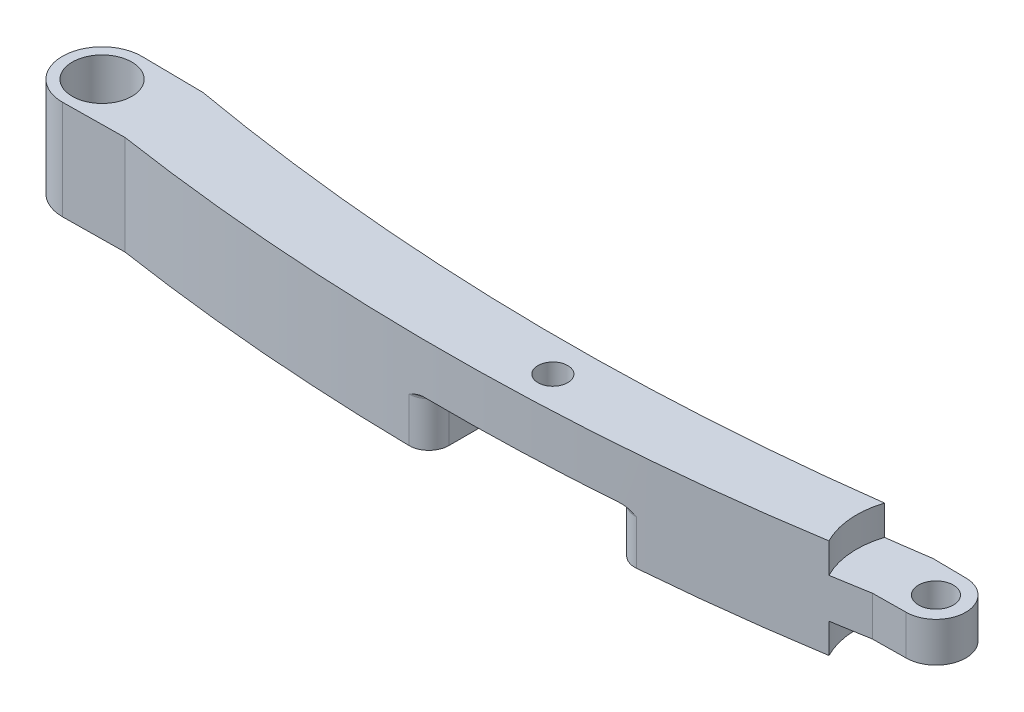
ISO-10303-21;
HEADER;
FILE_DESCRIPTION(('STEP AP214'),'2;1');
FILE_NAME('part.step','',(''),(''),'','','');
FILE_SCHEMA(('AUTOMOTIVE_DESIGN { 1 0 10303 214 1 1 1 1 }'));
ENDSEC;
DATA;
#1=APPLICATION_CONTEXT('core data for automotive mechanical design processes');
#2=APPLICATION_PROTOCOL_DEFINITION('international standard','automotive_design',2000,#1);
#3=PRODUCT_CONTEXT('',#1,'mechanical');
#4=PRODUCT('Part','Part','',(#3));
#5=PRODUCT_RELATED_PRODUCT_CATEGORY('part','',(#4));
#6=PRODUCT_DEFINITION_FORMATION('','',#4);
#7=PRODUCT_DEFINITION_CONTEXT('part definition',#1,'design');
#8=PRODUCT_DEFINITION('design','',#6,#7);
#9=PRODUCT_DEFINITION_SHAPE('','',#8);
#10=(LENGTH_UNIT() NAMED_UNIT(*) SI_UNIT(.MILLI.,.METRE.));
#11=(NAMED_UNIT(*) PLANE_ANGLE_UNIT() SI_UNIT($,.RADIAN.));
#12=(NAMED_UNIT(*) SI_UNIT($,.STERADIAN.) SOLID_ANGLE_UNIT());
#13=UNCERTAINTY_MEASURE_WITH_UNIT(LENGTH_MEASURE(1.E-05),#10,'distance_accuracy_value','');
#14=(GEOMETRIC_REPRESENTATION_CONTEXT(3) GLOBAL_UNCERTAINTY_ASSIGNED_CONTEXT((#13)) GLOBAL_UNIT_ASSIGNED_CONTEXT((#10,
#11,#12)) REPRESENTATION_CONTEXT('',''));
#15=CARTESIAN_POINT('',(0.,0.,0.));
#16=DIRECTION('',(0.,0.,1.));
#17=DIRECTION('',(1.,0.,0.));
#18=AXIS2_PLACEMENT_3D('',#15,#16,#17);
#19=CARTESIAN_POINT('',(0.,-5.,0.));
#20=DIRECTION('',(0.,1.,0.));
#21=DIRECTION('',(0.,0.,1.));
#22=AXIS2_PLACEMENT_3D('',#19,#20,#21);
#23=PLANE('',#22);
#24=CARTESIAN_POINT('',(-15.9655750112475,-5.,0.));
#25=DIRECTION('',(0.,1.,0.));
#26=DIRECTION('',(0.,0.,1.));
#27=AXIS2_PLACEMENT_3D('',#24,#25,#26);
#28=CIRCLE('',#27,3.);
#29=CARTESIAN_POINT('',(-15.9655750112475,-5.,3.));
#30=VERTEX_POINT('',#29);
#31=EDGE_CURVE('E247',#30,#30,#28,.T.);
#32=ORIENTED_EDGE('',*,*,#31,.T.);
#33=EDGE_LOOP('',(#32));
#34=FACE_BOUND('',#33,.T.);
#35=CARTESIAN_POINT('',(30.1677970186625,-5.,-230.43882689429));
#36=DIRECTION('',(0.,1.,0.));
#37=DIRECTION('',(0.,0.,1.));
#38=AXIS2_PLACEMENT_3D('',#35,#36,#37);
#39=CIRCLE('',#38,230.);
#40=CARTESIAN_POINT('',(21.5417969273626,-5.,-0.600640070548941));
#41=VERTEX_POINT('',#40);
#42=CARTESIAN_POINT('',(-9.72999293226271,-5.,-3.92576688001209));
#43=VERTEX_POINT('',#42);
#44=EDGE_CURVE('E275',#41,#43,#39,.F.);
#45=ORIENTED_EDGE('',*,*,#44,.F.);
#46=CARTESIAN_POINT('',(21.4667882309165,-5.,1.39795285835317));
#47=DIRECTION('',(0.,1.,0.));
#48=DIRECTION('',(0.,0.,1.));
#49=AXIS2_PLACEMENT_3D('',#46,#47,#48);
#50=CIRCLE('',#49,2.);
#51=CARTESIAN_POINT('',(23.4667882309166,-5.,1.39795285835317));
#52=VERTEX_POINT('',#51);
#53=EDGE_CURVE('E321',#41,#52,#50,.F.);
#54=ORIENTED_EDGE('',*,*,#53,.T.);
#55=DIRECTION('',(0.,0.,1.));
#56=VECTOR('',#55,1.);
#57=CARTESIAN_POINT('',(23.4667882309166,-5.,-4.));
#58=LINE('',#57,#56);
#59=CARTESIAN_POINT('',(23.4667882309166,-5.,4.50324565229376));
#60=VERTEX_POINT('',#59);
#61=EDGE_CURVE('E461',#52,#60,#58,.T.);
#62=ORIENTED_EDGE('',*,*,#61,.T.);
#63=CARTESIAN_POINT('',(21.4667882309165,-5.,4.50324565229376));
#64=DIRECTION('',(0.,1.,0.));
#65=DIRECTION('',(0.,0.,1.));
#66=AXIS2_PLACEMENT_3D('',#63,#64,#65);
#67=CIRCLE('',#66,2.);
#68=CARTESIAN_POINT('',(21.437864567523,-5.,6.50303649678125));
#69=VERTEX_POINT('',#68);
#70=EDGE_CURVE('E319',#60,#69,#67,.F.);
#71=ORIENTED_EDGE('',*,*,#70,.T.);
#72=CARTESIAN_POINT('',(24.7640858577867,-5.,-223.472910619277));
#73=DIRECTION('',(0.,1.,0.));
#74=DIRECTION('',(0.,0.,1.));
#75=AXIS2_PLACEMENT_3D('',#72,#73,#74);
#76=CIRCLE('',#75,230.);
#77=CARTESIAN_POINT('',(-9.72999293226271,-5.,3.92576688001209));
#78=VERTEX_POINT('',#77);
#79=EDGE_CURVE('E272',#78,#69,#76,.T.);
#80=ORIENTED_EDGE('',*,*,#79,.F.);
#81=DIRECTION('',(0.999929145853172,0.,-0.0119039184030139));
#82=VECTOR('',#81,1.);
#83=CARTESIAN_POINT('',(0.0453499256041875,-5.,3.80939375075177));
#84=LINE('',#83,#82);
#85=CARTESIAN_POINT('',(-15.9655750112475,-5.,4.));
#86=VERTEX_POINT('',#85);
#87=EDGE_CURVE('E268',#86,#78,#84,.T.);
#88=ORIENTED_EDGE('',*,*,#87,.F.);
#89=CARTESIAN_POINT('',(-15.9655750112475,-5.,0.));
#90=DIRECTION('',(0.,1.,0.));
#91=DIRECTION('',(0.,0.,1.));
#92=AXIS2_PLACEMENT_3D('',#89,#90,#91);
#93=CIRCLE('',#92,4.);
#94=CARTESIAN_POINT('',(-15.9655750112475,-5.,-4.));
#95=VERTEX_POINT('',#94);
#96=EDGE_CURVE('E252',#95,#86,#93,.T.);
#97=ORIENTED_EDGE('',*,*,#96,.F.);
#98=DIRECTION('',(0.999929145853172,0.,0.0119039184030139));
#99=VECTOR('',#98,1.);
#100=CARTESIAN_POINT('',(0.0453499256041875,-5.,-3.80939375075177));
#101=LINE('',#100,#99);
#102=EDGE_CURVE('E278',#95,#43,#101,.T.);
#103=ORIENTED_EDGE('',*,*,#102,.T.);
#104=EDGE_LOOP('',(#45,#54,#62,#71,#80,#88,#97,#103));
#105=FACE_BOUND('',#104,.T.);
#106=ADVANCED_FACE('F41',(#34,#105),#23,.F.);
#107=CARTESIAN_POINT('',(24.7640858577867,5.,-223.472910619277));
#108=DIRECTION('',(0.,-1.,0.));
#109=DIRECTION('',(0.,0.,-1.));
#110=AXIS2_PLACEMENT_3D('',#107,#108,#109);
#111=CYLINDRICAL_SURFACE('',#110,230.);
#112=DIRECTION('',(0.,-1.,0.));
#113=VECTOR('',#112,1.);
#114=CARTESIAN_POINT('',(21.437864567523,5.,6.50303649678125));
#115=LINE('',#114,#113);
#116=CARTESIAN_POINT('',(21.437864567523,-0.500000000000003,6.50303649678125));
#117=VERTEX_POINT('',#116);
#118=EDGE_CURVE('E337',#69,#117,#115,.F.);
#119=ORIENTED_EDGE('',*,*,#118,.T.);
#120=CARTESIAN_POINT('',(22.9443348755946,0.,6.51989036884661));
#121=CARTESIAN_POINT('',(22.8909089852407,-3.65314803075254E-05,6.51946780588924));
#122=CARTESIAN_POINT('',(22.8375854532841,-0.0030504474985046,6.51902713659814));
#123=CARTESIAN_POINT('',(22.7316020156731,-0.0140479396233299,6.51811483531317));
#124=CARTESIAN_POINT('',(22.678940590476,-0.0220164546860555,6.51764330101551));
#125=CARTESIAN_POINT('',(22.5750845731412,-0.0418220092257636,6.51667815301156));
#126=CARTESIAN_POINT('',(22.5238798287881,-0.0536080582595081,6.51618490058542));
#127=CARTESIAN_POINT('',(22.4222738876124,-0.0803654839305882,6.51517276330715));
#128=CARTESIAN_POINT('',(22.371873418203,-0.0953395858767263,6.51465385681788));
#129=CARTESIAN_POINT('',(22.2461769163341,-0.136207294617976,6.51331913085568));
#130=CARTESIAN_POINT('',(22.1714229675732,-0.163753634524398,6.51248799154131));
#131=CARTESIAN_POINT('',(22.0235323379046,-0.222922741607877,6.51077321209758));
#132=CARTESIAN_POINT('',(21.9503967235615,-0.254548108524291,6.50988953868131));
#133=CARTESIAN_POINT('',(21.7322471974395,-0.353512459338371,6.5071521162514));
#134=CARTESIAN_POINT('',(21.5890331263252,-0.424738635184619,6.50521778453675));
#135=CARTESIAN_POINT('',(21.4432253316456,-0.497331033007587,6.50311398390824));
#136=CARTESIAN_POINT('',(21.4405449419586,-0.49866552781418,6.50307526335833));
#137=CARTESIAN_POINT('',(21.437864567523,-0.500000000000003,6.50303649678123));
#138=B_SPLINE_CURVE_WITH_KNOTS('',3,(#120,#121,#122,#123,#124,#125,#126,#127,#128,#129,#130,
#131,#132,#133,#134,#135,#136,#137),.UNSPECIFIED.,.F.,.F.,(4,2,2,2,2,2,2,2,4),(0.,
0.160055796849207,0.319627417117926,0.477149947552301,0.634807680801527,0.873634829903894,
1.11261495301422,1.59230568562952,1.60128910114968),.UNSPECIFIED.);
#139=CARTESIAN_POINT('',(22.9443348755946,0.,6.51989036884662));
#140=VERTEX_POINT('',#139);
#141=EDGE_CURVE('E374',#117,#140,#138,.F.);
#142=ORIENTED_EDGE('',*,*,#141,.T.);
#143=CARTESIAN_POINT('',(24.7640858577867,0.,-223.472910619277));
#144=DIRECTION('',(0.,1.,0.));
#145=DIRECTION('',(-1.,0.,0.));
#146=AXIS2_PLACEMENT_3D('',#143,#144,#145);
#147=CIRCLE('',#146,230.);
#148=CARTESIAN_POINT('',(42.1289630012364,0.,5.87063309144689));
#149=VERTEX_POINT('',#148);
#150=EDGE_CURVE('E475',#140,#149,#147,.T.);
#151=ORIENTED_EDGE('',*,*,#150,.T.);
#152=CARTESIAN_POINT('',(42.1289630012364,0.,5.87063309144689));
#153=CARTESIAN_POINT('',(42.1822380835816,-3.65314802964132E-05,5.86659949247795));
#154=CARTESIAN_POINT('',(42.2354098175994,-0.00305044749846173,5.86255474882119));
#155=CARTESIAN_POINT('',(42.3410890844053,-0.0140479396231773,5.85447923591197));
#156=CARTESIAN_POINT('',(42.3935981398641,-0.0220164546858313,5.85044846139938));
#157=CARTESIAN_POINT('',(42.4971512811274,-0.0418220092254493,5.84246405272814));
#158=CARTESIAN_POINT('',(42.5482055203441,-0.053608058259216,5.83851009265485));
#159=CARTESIAN_POINT('',(42.6495105568295,-0.0803654839304287,5.83063092474933));
#160=CARTESIAN_POINT('',(42.6997606268864,-0.095339585876675,5.82670574450821));
#161=CARTESIAN_POINT('',(42.8250792949011,-0.136207294617914,5.81687601803217));
#162=CARTESIAN_POINT('',(42.8996060137187,-0.163753634524105,5.81099283605296));
#163=CARTESIAN_POINT('',(43.0470423343804,-0.222922741608122,5.79928343120091));
#164=CARTESIAN_POINT('',(43.1199508698498,-0.254548108525309,5.79345724722531));
#165=CARTESIAN_POINT('',(43.3374161946639,-0.353512459336386,5.77597749514156));
#166=CARTESIAN_POINT('',(43.4801718134044,-0.424738635173634,5.76436521183776));
#167=CARTESIAN_POINT('',(43.6255037638026,-0.497331033007014,5.75240849162221));
#168=CARTESIAN_POINT('',(43.6281754028971,-0.498665527813889,5.75218864461978));
#169=CARTESIAN_POINT('',(43.6308470236633,-0.5,5.75196875272657));
#170=B_SPLINE_CURVE_WITH_KNOTS('',3,(#152,#153,#154,#155,#156,#157,#158,#159,#160,#161,#162,
#163,#164,#165,#166,#167,#168,#169),.UNSPECIFIED.,.F.,.F.,(4,2,2,2,2,2,2,2,4),(0.,
0.160055796848258,0.319627417116233,0.47714994755149,0.634807680801499,0.873634829903871,
1.11261495301443,1.592305685629,1.60128910114972),.UNSPECIFIED.);
#171=CARTESIAN_POINT('',(43.6308470236633,-0.5,5.75196875272663));
#172=VERTEX_POINT('',#171);
#173=EDGE_CURVE('E367',#149,#172,#170,.T.);
#174=ORIENTED_EDGE('',*,*,#173,.T.);
#175=DIRECTION('',(0.,-1.,0.));
#176=VECTOR('',#175,1.);
#177=CARTESIAN_POINT('',(43.6308470236633,5.,5.75196875272663));
#178=LINE('',#177,#176);
#179=CARTESIAN_POINT('',(43.6308470236633,-5.,5.75196875272657));
#180=VERTEX_POINT('',#179);
#181=EDGE_CURVE('E340',#172,#180,#178,.T.);
#182=ORIENTED_EDGE('',*,*,#181,.T.);
#183=CARTESIAN_POINT('',(60.924244803066,-5.,3.6667884759097));
#184=VERTEX_POINT('',#183);
#185=EDGE_CURVE('E271',#180,#184,#76,.T.);
#186=ORIENTED_EDGE('',*,*,#185,.T.);
#187=DIRECTION('',(0.,1.,0.));
#188=VECTOR('',#187,1.);
#189=CARTESIAN_POINT('',(60.9242448030656,-3.5,3.66678847590988));
#190=LINE('',#189,#188);
#191=CARTESIAN_POINT('',(60.9242448030656,-2.,3.66678847590975));
#192=VERTEX_POINT('',#191);
#193=EDGE_CURVE('E217',#192,#184,#190,.F.);
#194=ORIENTED_EDGE('',*,*,#193,.F.);
#195=CARTESIAN_POINT('',(24.7640858577867,-1.99999999999997,-223.472910619277));
#196=DIRECTION('',(0.,-1.,0.));
#197=DIRECTION('',(0.,0.,-1.));
#198=AXIS2_PLACEMENT_3D('',#195,#196,#197);
#199=CIRCLE('',#198,230.);
#200=CARTESIAN_POINT('',(64.6618758087119,-2.,3.04014939500048));
#201=VERTEX_POINT('',#200);
#202=EDGE_CURVE('E224',#201,#192,#199,.T.);
#203=ORIENTED_EDGE('',*,*,#202,.F.);
#204=DIRECTION('',(0.,-1.,0.));
#205=VECTOR('',#204,1.);
#206=CARTESIAN_POINT('',(64.6618758087119,5.,3.04014939500048));
#207=LINE('',#206,#205);
#208=CARTESIAN_POINT('',(64.6618758087119,2.,3.04014939500048));
#209=VERTEX_POINT('',#208);
#210=EDGE_CURVE('E296',#209,#201,#207,.T.);
#211=ORIENTED_EDGE('',*,*,#210,.F.);
#212=CARTESIAN_POINT('',(24.7640858577867,2.00000000000003,-223.472910619277));
#213=DIRECTION('',(0.,1.,0.));
#214=DIRECTION('',(0.,0.,1.));
#215=AXIS2_PLACEMENT_3D('',#212,#213,#214);
#216=CIRCLE('',#215,230.);
#217=CARTESIAN_POINT('',(60.9242448030656,2.,3.66678847590975));
#218=VERTEX_POINT('',#217);
#219=EDGE_CURVE('E238',#218,#209,#216,.T.);
#220=ORIENTED_EDGE('',*,*,#219,.F.);
#221=DIRECTION('',(0.,1.,0.));
#222=VECTOR('',#221,1.);
#223=CARTESIAN_POINT('',(60.9242448030656,3.5,3.66678847590988));
#224=LINE('',#223,#222);
#225=CARTESIAN_POINT('',(60.924244803066,5.,3.6667884759097));
#226=VERTEX_POINT('',#225);
#227=EDGE_CURVE('E309',#226,#218,#224,.F.);
#228=ORIENTED_EDGE('',*,*,#227,.F.);
#229=CARTESIAN_POINT('',(24.7640858577867,5.,-223.472910619277));
#230=DIRECTION('',(0.,1.,0.));
#231=DIRECTION('',(0.,0.,1.));
#232=AXIS2_PLACEMENT_3D('',#229,#230,#231);
#233=CIRCLE('',#232,230.);
#234=CARTESIAN_POINT('',(-9.72999293226271,5.,3.92576688001209));
#235=VERTEX_POINT('',#234);
#236=EDGE_CURVE('E255',#235,#226,#233,.T.);
#237=ORIENTED_EDGE('',*,*,#236,.F.);
#238=DIRECTION('',(0.,-1.,0.));
#239=VECTOR('',#238,1.);
#240=CARTESIAN_POINT('',(-9.72999293226271,5.,3.92576688001209));
#241=LINE('',#240,#239);
#242=EDGE_CURVE('E299',#235,#78,#241,.T.);
#243=ORIENTED_EDGE('',*,*,#242,.T.);
#244=ORIENTED_EDGE('',*,*,#79,.T.);
#245=EDGE_LOOP('',(#119,#142,#151,#174,#182,#186,#194,#203,#211,#220,#228,#237,#243,#244));
#246=FACE_BOUND('',#245,.T.);
#247=ADVANCED_FACE('F380',(#246),#111,.T.);
#248=CARTESIAN_POINT('',(0.045349925604188,5.,3.80939375075177));
#249=DIRECTION('',(-0.011903918403014,0.,-0.999929145853172));
#250=DIRECTION('',(-0.999929145853172,0.,0.011903918403014));
#251=AXIS2_PLACEMENT_3D('',#248,#249,#250);
#252=PLANE('',#251);
#253=DIRECTION('',(-0.999929145853172,0.,0.011903918403014));
#254=VECTOR('',#253,1.);
#255=CARTESIAN_POINT('',(0.045349925604188,-2.,3.80939375075177));
#256=LINE('',#255,#254);
#257=CARTESIAN_POINT('',(68.0344249887525,-2.,3.));
#258=VERTEX_POINT('',#257);
#259=EDGE_CURVE('E244',#258,#201,#256,.T.);
#260=ORIENTED_EDGE('',*,*,#259,.F.);
#261=DIRECTION('',(0.,-1.,0.));
#262=VECTOR('',#261,1.);
#263=CARTESIAN_POINT('',(68.0344249887525,5.,3.));
#264=LINE('',#263,#262);
#265=CARTESIAN_POINT('',(68.0344249887525,2.,3.));
#266=VERTEX_POINT('',#265);
#267=EDGE_CURVE('E293',#266,#258,#264,.T.);
#268=ORIENTED_EDGE('',*,*,#267,.F.);
#269=DIRECTION('',(0.999929145853172,0.,-0.011903918403014));
#270=VECTOR('',#269,1.);
#271=CARTESIAN_POINT('',(0.045349925604188,2.,3.80939375075177));
#272=LINE('',#271,#270);
#273=EDGE_CURVE('E496',#209,#266,#272,.T.);
#274=ORIENTED_EDGE('',*,*,#273,.F.);
#275=ORIENTED_EDGE('',*,*,#210,.T.);
#276=EDGE_LOOP('',(#260,#268,#274,#275));
#277=FACE_BOUND('',#276,.T.);
#278=ADVANCED_FACE('F424',(#277),#252,.F.);
#279=CARTESIAN_POINT('',(68.0344249887525,5.,0.));
#280=DIRECTION('',(0.,-1.,0.));
#281=DIRECTION('',(0.,0.,-1.));
#282=AXIS2_PLACEMENT_3D('',#279,#280,#281);
#283=CYLINDRICAL_SURFACE('',#282,3.);
#284=CARTESIAN_POINT('',(68.0344249887525,-2.,0.));
#285=DIRECTION('',(0.,-1.,0.));
#286=DIRECTION('',(0.,0.,-1.));
#287=AXIS2_PLACEMENT_3D('',#284,#285,#286);
#288=CIRCLE('',#287,3.);
#289=CARTESIAN_POINT('',(68.0344249887525,-2.,-3.));
#290=VERTEX_POINT('',#289);
#291=EDGE_CURVE('E235',#290,#258,#288,.T.);
#292=ORIENTED_EDGE('',*,*,#291,.F.);
#293=DIRECTION('',(0.,-1.,0.));
#294=VECTOR('',#293,1.);
#295=CARTESIAN_POINT('',(68.0344249887525,5.,-3.));
#296=LINE('',#295,#294);
#297=CARTESIAN_POINT('',(68.0344249887525,2.,-3.));
#298=VERTEX_POINT('',#297);
#299=EDGE_CURVE('E290',#298,#290,#296,.T.);
#300=ORIENTED_EDGE('',*,*,#299,.F.);
#301=CARTESIAN_POINT('',(68.0344249887525,2.,0.));
#302=DIRECTION('',(0.,1.,0.));
#303=DIRECTION('',(0.,0.,1.));
#304=AXIS2_PLACEMENT_3D('',#301,#302,#303);
#305=CIRCLE('',#304,3.);
#306=EDGE_CURVE('E495',#266,#298,#305,.T.);
#307=ORIENTED_EDGE('',*,*,#306,.F.);
#308=ORIENTED_EDGE('',*,*,#267,.T.);
#309=EDGE_LOOP('',(#292,#300,#307,#308));
#310=FACE_BOUND('',#309,.T.);
#311=ADVANCED_FACE('F421',(#310),#283,.T.);
#312=CARTESIAN_POINT('',(0.0453499256041882,5.,-3.80939375075177));
#313=DIRECTION('',(0.0119039184030141,0.,-0.999929145853172));
#314=DIRECTION('',(-0.999929145853172,0.,-0.0119039184030141));
#315=AXIS2_PLACEMENT_3D('',#312,#313,#314);
#316=PLANE('',#315);
#317=ORIENTED_EDGE('',*,*,#299,.T.);
#318=DIRECTION('',(-0.999929145853172,0.,-0.0119039184030141));
#319=VECTOR('',#318,1.);
#320=CARTESIAN_POINT('',(0.0453499256041882,-2.,-3.80939375075177));
#321=LINE('',#320,#319);
#322=CARTESIAN_POINT('',(64.6618758087119,-2.,-3.0401493950005));
#323=VERTEX_POINT('',#322);
#324=EDGE_CURVE('E232',#290,#323,#321,.T.);
#325=ORIENTED_EDGE('',*,*,#324,.T.);
#326=DIRECTION('',(0.,-1.,0.));
#327=VECTOR('',#326,1.);
#328=CARTESIAN_POINT('',(64.6618758087119,5.,-3.04014939500048));
#329=LINE('',#328,#327);
#330=CARTESIAN_POINT('',(64.6618758087119,2.,-3.0401493950005));
#331=VERTEX_POINT('',#330);
#332=EDGE_CURVE('E231',#331,#323,#329,.T.);
#333=ORIENTED_EDGE('',*,*,#332,.F.);
#334=DIRECTION('',(0.999929145853172,0.,0.0119039184030141));
#335=VECTOR('',#334,1.);
#336=CARTESIAN_POINT('',(0.0453499256041882,2.,-3.80939375075177));
#337=LINE('',#336,#335);
#338=EDGE_CURVE('E492',#331,#298,#337,.T.);
#339=ORIENTED_EDGE('',*,*,#338,.T.);
#340=EDGE_LOOP('',(#317,#325,#333,#339));
#341=FACE_BOUND('',#340,.T.);
#342=ADVANCED_FACE('F415',(#341),#316,.T.);
#343=CARTESIAN_POINT('',(30.1677970186625,5.,-230.43882689429));
#344=DIRECTION('',(0.,-1.,0.));
#345=DIRECTION('',(0.,0.,-1.));
#346=AXIS2_PLACEMENT_3D('',#343,#344,#345);
#347=CYLINDRICAL_SURFACE('',#346,230.);
#348=DIRECTION('',(0.,-1.,0.));
#349=VECTOR('',#348,1.);
#350=CARTESIAN_POINT('',(43.3521417549489,5.,-0.817022498725728));
#351=LINE('',#350,#349);
#352=CARTESIAN_POINT('',(43.3521417549489,-5.,-0.817022498725756));
#353=VERTEX_POINT('',#352);
#354=CARTESIAN_POINT('',(43.3521417549489,-0.5,-0.817022498725728));
#355=VERTEX_POINT('',#354);
#356=EDGE_CURVE('E305',#353,#355,#351,.F.);
#357=ORIENTED_EDGE('',*,*,#356,.T.);
#358=CARTESIAN_POINT('',(41.8608069963465,0.,-0.736250683961438));
#359=CARTESIAN_POINT('',(41.9134203674278,-3.56024346881378E-05,-0.738928816562597));
#360=CARTESIAN_POINT('',(41.9659315841815,-0.00301796296769725,-0.741620166540574));
#361=CARTESIAN_POINT('',(42.0702938894028,-0.0139024725655392,-0.747004508732391));
#362=CARTESIAN_POINT('',(42.1221465020544,-0.0217895990163154,-0.749697470939459));
#363=CARTESIAN_POINT('',(42.2243917689125,-0.0413936747347646,-0.755041838299885));
#364=CARTESIAN_POINT('',(42.2747946381605,-0.0530595510093309,-0.757693328919903));
#365=CARTESIAN_POINT('',(42.3748007741097,-0.0795458334883899,-0.762986704892801));
#366=CARTESIAN_POINT('',(42.4244033112971,-0.0943689601448161,-0.765628579950893));
#367=CARTESIAN_POINT('',(42.5489025563035,-0.135090587195379,-0.772299248532465));
#368=CARTESIAN_POINT('',(42.6232388797979,-0.162689611445872,-0.776319299476885));
#369=CARTESIAN_POINT('',(42.7702662598534,-0.222004764894087,-0.784340365025305));
#370=CARTESIAN_POINT('',(42.8429561915289,-0.253723614871186,-0.788341365221589));
#371=CARTESIAN_POINT('',(43.0597480759411,-0.353006500108393,-0.800374757414143));
#372=CARTESIAN_POINT('',(43.2020186770184,-0.42449016441692,-0.808407826726177));
#373=CARTESIAN_POINT('',(43.3468448071096,-0.497335671265506,-0.816718406974901));
#374=CARTESIAN_POINT('',(43.3494932895905,-0.498667847237718,-0.816870430667273));
#375=CARTESIAN_POINT('',(43.3521417549489,-0.5,-0.817022498725756));
#376=B_SPLINE_CURVE_WITH_KNOTS('',3,(#358,#359,#360,#361,#362,#363,#364,#365,#366,#367,#368,
#369,#370,#371,#372,#373,#374,#375),.UNSPECIFIED.,.F.,.F.,(4,2,2,2,2,2,2,2,4),(0.,
0.157819298907594,0.315157584037585,0.470452328727351,0.625881428751009,0.863875199579752,
1.10202695102831,1.58009943635322,1.58900507191982),.UNSPECIFIED.);
#377=CARTESIAN_POINT('',(41.8608069963465,0.,-0.736250683961437));
#378=VERTEX_POINT('',#377);
#379=EDGE_CURVE('E51',#355,#378,#376,.F.);
#380=ORIENTED_EDGE('',*,*,#379,.T.);
#381=CARTESIAN_POINT('',(30.1677970186625,0.,-230.43882689429));
#382=DIRECTION('',(0.,1.,0.));
#383=DIRECTION('',(-1.,0.,0.));
#384=AXIS2_PLACEMENT_3D('',#381,#382,#383);
#385=CIRCLE('',#384,230.);
#386=CARTESIAN_POINT('',(23.0344406678973,0.,-0.549472579713245));
#387=VERTEX_POINT('',#386);
#388=EDGE_CURVE('E314',#378,#387,#385,.F.);
#389=ORIENTED_EDGE('',*,*,#388,.T.);
#390=CARTESIAN_POINT('',(23.0344406678973,0.,-0.549472579713242));
#391=CARTESIAN_POINT('',(22.9817845182925,-3.56024346867236E-05,-0.551106323760339));
#392=CARTESIAN_POINT('',(22.9292302406718,-0.00301796296774121,-0.552755309347937));
#393=CARTESIAN_POINT('',(22.8247816511968,-0.0139024725657358,-0.556068019532952));
#394=CARTESIAN_POINT('',(22.7728858160539,-0.0217895990166111,-0.557731683889343));
#395=CARTESIAN_POINT('',(22.6705546413418,-0.0413936747351605,-0.561046429640176));
#396=CARTESIAN_POINT('',(22.6201090870462,-0.0530595510096775,-0.56269739381568));
#397=CARTESIAN_POINT('',(22.5200176141812,-0.079545833488569,-0.566005583088867));
#398=CARTESIAN_POINT('',(22.4703724251864,-0.0943689601448797,-0.567662812367511));
#399=CARTESIAN_POINT('',(22.3457653386052,-0.135090587195435,-0.571862074223061));
#400=CARTESIAN_POINT('',(22.2713638884941,-0.16268961144615,-0.574406484095828));
#401=CARTESIAN_POINT('',(22.1242063090411,-0.222004764893581,-0.579508913722896));
#402=CARTESIAN_POINT('',(22.0514513046493,-0.253723614869668,-0.582066941390309));
#403=CARTESIAN_POINT('',(21.8344633475747,-0.353006500110582,-0.589796764054694));
#404=CARTESIAN_POINT('',(21.6920613726392,-0.42449016443044,-0.595005570672523));
#405=CARTESIAN_POINT('',(21.5470988658187,-0.497335671265953,-0.600441131319507));
#406=CARTESIAN_POINT('',(21.5444478884712,-0.498667847237947,-0.600540578585671));
#407=CARTESIAN_POINT('',(21.5417969273626,-0.500000000000003,-0.600640070548929));
#408=B_SPLINE_CURVE_WITH_KNOTS('',3,(#390,#391,#392,#393,#394,#395,#396,#397,#398,#399,#400,
#401,#402,#403,#404,#405,#406,#407),.UNSPECIFIED.,.F.,.F.,(4,2,2,2,2,2,2,2,4),(0.,
0.157819298908778,0.315157584039693,0.470452328728353,0.62588142875104,0.863875199579542,
1.10202695102758,1.58009943635297,1.58900507191978),.UNSPECIFIED.);
#409=CARTESIAN_POINT('',(21.5417969273626,-0.500000000000003,-0.600640070548886));
#410=VERTEX_POINT('',#409);
#411=EDGE_CURVE('E11',#387,#410,#408,.T.);
#412=ORIENTED_EDGE('',*,*,#411,.T.);
#413=DIRECTION('',(0.,-1.,0.));
#414=VECTOR('',#413,1.);
#415=CARTESIAN_POINT('',(21.5417969273626,5.,-0.600640070548886));
#416=LINE('',#415,#414);
#417=EDGE_CURVE('E317',#410,#41,#416,.T.);
#418=ORIENTED_EDGE('',*,*,#417,.T.);
#419=ORIENTED_EDGE('',*,*,#44,.T.);
#420=DIRECTION('',(0.,-1.,0.));
#421=VECTOR('',#420,1.);
#422=CARTESIAN_POINT('',(-9.72999293226271,5.,-3.92576688001209));
#423=LINE('',#422,#421);
#424=CARTESIAN_POINT('',(-9.72999293226271,5.,-3.92576688001209));
#425=VERTEX_POINT('',#424);
#426=EDGE_CURVE('E286',#425,#43,#423,.T.);
#427=ORIENTED_EDGE('',*,*,#426,.F.);
#428=CARTESIAN_POINT('',(30.1677970186625,5.,-230.43882689429));
#429=DIRECTION('',(0.,1.,0.));
#430=DIRECTION('',(0.,0.,1.));
#431=AXIS2_PLACEMENT_3D('',#428,#429,#430);
#432=CIRCLE('',#431,230.);
#433=CARTESIAN_POINT('',(60.4144299780924,5.,-2.43632428824944));
#434=VERTEX_POINT('',#433);
#435=EDGE_CURVE('E258',#434,#425,#432,.F.);
#436=ORIENTED_EDGE('',*,*,#435,.F.);
#437=DIRECTION('',(0.,1.,0.));
#438=VECTOR('',#437,1.);
#439=CARTESIAN_POINT('',(60.4144299780924,3.5,-2.43632428824944));
#440=LINE('',#439,#438);
#441=CARTESIAN_POINT('',(60.4144299780923,2.,-2.43632428824941));
#442=VERTEX_POINT('',#441);
#443=EDGE_CURVE('E488',#442,#434,#440,.T.);
#444=ORIENTED_EDGE('',*,*,#443,.F.);
#445=CARTESIAN_POINT('',(30.1677970186625,2.00000000000003,-230.43882689429));
#446=DIRECTION('',(0.,1.,0.));
#447=DIRECTION('',(0.,0.,1.));
#448=AXIS2_PLACEMENT_3D('',#445,#446,#447);
#449=CIRCLE('',#448,230.);
#450=EDGE_CURVE('E308',#331,#442,#449,.F.);
#451=ORIENTED_EDGE('',*,*,#450,.F.);
#452=ORIENTED_EDGE('',*,*,#332,.T.);
#453=CARTESIAN_POINT('',(30.1677970186625,-1.99999999999997,-230.43882689429));
#454=DIRECTION('',(0.,-1.,0.));
#455=DIRECTION('',(0.,0.,-1.));
#456=AXIS2_PLACEMENT_3D('',#453,#454,#455);
#457=CIRCLE('',#456,230.);
#458=CARTESIAN_POINT('',(60.4144299780923,-2.,-2.43632428824941));
#459=VERTEX_POINT('',#458);
#460=EDGE_CURVE('E221',#459,#323,#457,.F.);
#461=ORIENTED_EDGE('',*,*,#460,.F.);
#462=DIRECTION('',(0.,1.,0.));
#463=VECTOR('',#462,1.);
#464=CARTESIAN_POINT('',(60.4144299780924,-3.5,-2.43632428824944));
#465=LINE('',#464,#463);
#466=CARTESIAN_POINT('',(60.4144299780924,-5.,-2.43632428824944));
#467=VERTEX_POINT('',#466);
#468=EDGE_CURVE('E206',#467,#459,#465,.T.);
#469=ORIENTED_EDGE('',*,*,#468,.F.);
#470=EDGE_CURVE('E276',#467,#353,#39,.F.);
#471=ORIENTED_EDGE('',*,*,#470,.T.);
#472=EDGE_LOOP('',(#357,#380,#389,#412,#418,#419,#427,#436,#444,#451,#452,#461,#469,#471));
#473=FACE_BOUND('',#472,.T.);
#474=ADVANCED_FACE('F228',(#473),#347,.F.);
#475=CARTESIAN_POINT('',(0.0453499256041875,5.,3.80939375075177));
#476=DIRECTION('',(-0.0119039184030139,0.,-0.999929145853172));
#477=DIRECTION('',(-0.999929145853172,0.,0.0119039184030139));
#478=AXIS2_PLACEMENT_3D('',#475,#476,#477);
#479=PLANE('',#478);
#480=ORIENTED_EDGE('',*,*,#87,.T.);
#481=ORIENTED_EDGE('',*,*,#242,.F.);
#482=DIRECTION('',(0.999929145853172,0.,-0.0119039184030139));
#483=VECTOR('',#482,1.);
#484=CARTESIAN_POINT('',(0.0453499256041875,5.,3.80939375075177));
#485=LINE('',#484,#483);
#486=CARTESIAN_POINT('',(-15.9655750112475,5.,4.));
#487=VERTEX_POINT('',#486);
#488=EDGE_CURVE('E251',#487,#235,#485,.T.);
#489=ORIENTED_EDGE('',*,*,#488,.F.);
#490=DIRECTION('',(0.,-1.,0.));
#491=VECTOR('',#490,1.);
#492=CARTESIAN_POINT('',(-15.9655750112475,5.,4.));
#493=LINE('',#492,#491);
#494=EDGE_CURVE('E265',#487,#86,#493,.T.);
#495=ORIENTED_EDGE('',*,*,#494,.T.);
#496=EDGE_LOOP('',(#480,#481,#489,#495));
#497=FACE_BOUND('',#496,.T.);
#498=ADVANCED_FACE('F414',(#497),#479,.F.);
#499=CARTESIAN_POINT('',(0.0453499256041875,5.,-3.80939375075177));
#500=DIRECTION('',(0.0119039184030139,0.,-0.999929145853172));
#501=DIRECTION('',(-0.999929145853172,0.,-0.0119039184030139));
#502=AXIS2_PLACEMENT_3D('',#499,#500,#501);
#503=PLANE('',#502);
#504=ORIENTED_EDGE('',*,*,#102,.F.);
#505=DIRECTION('',(0.,-1.,0.));
#506=VECTOR('',#505,1.);
#507=CARTESIAN_POINT('',(-15.9655750112475,5.,-4.));
#508=LINE('',#507,#506);
#509=CARTESIAN_POINT('',(-15.9655750112475,5.,-4.));
#510=VERTEX_POINT('',#509);
#511=EDGE_CURVE('E284',#510,#95,#508,.T.);
#512=ORIENTED_EDGE('',*,*,#511,.F.);
#513=DIRECTION('',(0.999929145853172,0.,0.0119039184030139));
#514=VECTOR('',#513,1.);
#515=CARTESIAN_POINT('',(0.0453499256041875,5.,-3.80939375075177));
#516=LINE('',#515,#514);
#517=EDGE_CURVE('E260',#510,#425,#516,.T.);
#518=ORIENTED_EDGE('',*,*,#517,.T.);
#519=ORIENTED_EDGE('',*,*,#426,.T.);
#520=EDGE_LOOP('',(#504,#512,#518,#519));
#521=FACE_BOUND('',#520,.T.);
#522=ADVANCED_FACE('F416',(#521),#503,.T.);
#523=CARTESIAN_POINT('',(-15.9655750112475,5.,0.));
#524=DIRECTION('',(0.,-1.,0.));
#525=DIRECTION('',(0.,0.,-1.));
#526=AXIS2_PLACEMENT_3D('',#523,#524,#525);
#527=CYLINDRICAL_SURFACE('',#526,3.);
#528=CARTESIAN_POINT('',(-15.9655750112475,5.,0.));
#529=DIRECTION('',(0.,1.,0.));
#530=DIRECTION('',(0.,0.,1.));
#531=AXIS2_PLACEMENT_3D('',#528,#529,#530);
#532=CIRCLE('',#531,3.);
#533=CARTESIAN_POINT('',(-15.9655750112475,5.,3.));
#534=VERTEX_POINT('',#533);
#535=EDGE_CURVE('E248',#534,#534,#532,.T.);
#536=ORIENTED_EDGE('',*,*,#535,.T.);
#537=EDGE_LOOP('',(#536));
#538=FACE_BOUND('',#537,.T.);
#539=ORIENTED_EDGE('',*,*,#31,.F.);
#540=EDGE_LOOP('',(#539));
#541=FACE_BOUND('',#540,.T.);
#542=ADVANCED_FACE('F714',(#538,#541),#527,.F.);
#543=CARTESIAN_POINT('',(-15.9655750112475,5.,0.));
#544=DIRECTION('',(0.,-1.,0.));
#545=DIRECTION('',(0.,0.,-1.));
#546=AXIS2_PLACEMENT_3D('',#543,#544,#545);
#547=CYLINDRICAL_SURFACE('',#546,4.);
#548=ORIENTED_EDGE('',*,*,#96,.T.);
#549=ORIENTED_EDGE('',*,*,#494,.F.);
#550=CARTESIAN_POINT('',(-15.9655750112475,5.,0.));
#551=DIRECTION('',(0.,1.,0.));
#552=DIRECTION('',(0.,0.,1.));
#553=AXIS2_PLACEMENT_3D('',#550,#551,#552);
#554=CIRCLE('',#553,4.);
#555=EDGE_CURVE('E263',#510,#487,#554,.T.);
#556=ORIENTED_EDGE('',*,*,#555,.F.);
#557=ORIENTED_EDGE('',*,*,#511,.T.);
#558=EDGE_LOOP('',(#548,#549,#556,#557));
#559=FACE_BOUND('',#558,.T.);
#560=ADVANCED_FACE('F452',(#559),#547,.T.);
#561=CARTESIAN_POINT('',(0.,5.,0.));
#562=DIRECTION('',(0.,1.,0.));
#563=DIRECTION('',(0.,0.,1.));
#564=AXIS2_PLACEMENT_3D('',#561,#562,#563);
#565=PLANE('',#564);
#566=CARTESIAN_POINT('',(32.4667882309166,5.,3.02280968401822));
#567=DIRECTION('',(0.,1.,0.));
#568=DIRECTION('',(0.,0.,1.));
#569=AXIS2_PLACEMENT_3D('',#566,#567,#568);
#570=CIRCLE('',#569,1.5);
#571=CARTESIAN_POINT('',(32.4667882309166,5.,4.52280968401822));
#572=VERTEX_POINT('',#571);
#573=EDGE_CURVE('E478',#572,#572,#570,.T.);
#574=ORIENTED_EDGE('',*,*,#573,.F.);
#575=EDGE_LOOP('',(#574));
#576=FACE_BOUND('',#575,.T.);
#577=ORIENTED_EDGE('',*,*,#535,.F.);
#578=EDGE_LOOP('',(#577));
#579=FACE_BOUND('',#578,.T.);
#580=ORIENTED_EDGE('',*,*,#236,.T.);
#581=CARTESIAN_POINT('',(68.0344249887525,5.,0.));
#582=DIRECTION('',(0.,1.,0.));
#583=DIRECTION('',(0.,0.,1.));
#584=AXIS2_PLACEMENT_3D('',#581,#582,#583);
#585=CIRCLE('',#584,8.);
#586=EDGE_CURVE('E302',#226,#434,#585,.F.);
#587=ORIENTED_EDGE('',*,*,#586,.T.);
#588=ORIENTED_EDGE('',*,*,#435,.T.);
#589=ORIENTED_EDGE('',*,*,#517,.F.);
#590=ORIENTED_EDGE('',*,*,#555,.T.);
#591=ORIENTED_EDGE('',*,*,#488,.T.);
#592=EDGE_LOOP('',(#580,#587,#588,#589,#590,#591));
#593=FACE_BOUND('',#592,.T.);
#594=ADVANCED_FACE('F444',(#576,#579,#593),#565,.T.);
#595=DIRECTION('',(0.,0.,1.));
#596=VECTOR('',#595,1.);
#597=CARTESIAN_POINT('',(41.4667882309166,-5.,-4.));
#598=LINE('',#597,#596);
#599=CARTESIAN_POINT('',(41.4667882309166,-5.,1.17968884384437));
#600=VERTEX_POINT('',#599);
#601=CARTESIAN_POINT('',(41.4667882309166,-5.,3.75870893210045));
#602=VERTEX_POINT('',#601);
#603=EDGE_CURVE('E315',#600,#602,#598,.T.);
#604=ORIENTED_EDGE('',*,*,#603,.F.);
#605=CARTESIAN_POINT('',(43.4667882309166,-5.,1.17968884384437));
#606=DIRECTION('',(0.,1.,0.));
#607=DIRECTION('',(0.,0.,1.));
#608=AXIS2_PLACEMENT_3D('',#605,#606,#607);
#609=CIRCLE('',#608,2.);
#610=EDGE_CURVE('E335',#600,#353,#609,.F.);
#611=ORIENTED_EDGE('',*,*,#610,.T.);
#612=ORIENTED_EDGE('',*,*,#470,.F.);
#613=CARTESIAN_POINT('',(68.0344249887525,-5.,0.));
#614=DIRECTION('',(0.,1.,0.));
#615=DIRECTION('',(0.,0.,1.));
#616=AXIS2_PLACEMENT_3D('',#613,#614,#615);
#617=CIRCLE('',#616,8.);
#618=EDGE_CURVE('E213',#467,#184,#617,.T.);
#619=ORIENTED_EDGE('',*,*,#618,.T.);
#620=ORIENTED_EDGE('',*,*,#185,.F.);
#621=CARTESIAN_POINT('',(43.4667882309166,-5.,3.75870893210045));
#622=DIRECTION('',(0.,1.,0.));
#623=DIRECTION('',(0.,0.,1.));
#624=AXIS2_PLACEMENT_3D('',#621,#622,#623);
#625=CIRCLE('',#624,2.);
#626=EDGE_CURVE('E333',#180,#602,#625,.F.);
#627=ORIENTED_EDGE('',*,*,#626,.T.);
#628=EDGE_LOOP('',(#604,#611,#612,#619,#620,#627));
#629=FACE_BOUND('',#628,.T.);
#630=ADVANCED_FACE('F437',(#629),#23,.F.);
#631=CARTESIAN_POINT('',(68.0344249887525,-2.,-8.));
#632=DIRECTION('',(0.,-1.,0.));
#633=DIRECTION('',(0.,0.,-1.));
#634=AXIS2_PLACEMENT_3D('',#631,#632,#633);
#635=PLANE('',#634);
#636=CARTESIAN_POINT('',(68.0344249887525,-2.,0.));
#637=DIRECTION('',(0.,-1.,0.));
#638=DIRECTION('',(0.,0.,-1.));
#639=AXIS2_PLACEMENT_3D('',#636,#637,#638);
#640=CIRCLE('',#639,1.75);
#641=CARTESIAN_POINT('',(68.0344249887525,-2.,-1.75));
#642=VERTEX_POINT('',#641);
#643=EDGE_CURVE('E233',#642,#642,#640,.T.);
#644=ORIENTED_EDGE('',*,*,#643,.F.);
#645=EDGE_LOOP('',(#644));
#646=FACE_BOUND('',#645,.T.);
#647=ORIENTED_EDGE('',*,*,#202,.T.);
#648=CARTESIAN_POINT('',(68.0344249887525,-2.,0.));
#649=DIRECTION('',(0.,1.,0.));
#650=DIRECTION('',(0.,0.,1.));
#651=AXIS2_PLACEMENT_3D('',#648,#649,#650);
#652=CIRCLE('',#651,8.);
#653=EDGE_CURVE('E210',#459,#192,#652,.T.);
#654=ORIENTED_EDGE('',*,*,#653,.F.);
#655=ORIENTED_EDGE('',*,*,#460,.T.);
#656=ORIENTED_EDGE('',*,*,#324,.F.);
#657=ORIENTED_EDGE('',*,*,#291,.T.);
#658=ORIENTED_EDGE('',*,*,#259,.T.);
#659=EDGE_LOOP('',(#647,#654,#655,#656,#657,#658));
#660=FACE_BOUND('',#659,.T.);
#661=ADVANCED_FACE('F220',(#646,#660),#635,.T.);
#662=CARTESIAN_POINT('',(68.0344249887525,6.01049549134913,0.));
#663=DIRECTION('',(0.,1.,0.));
#664=DIRECTION('',(0.,0.,1.));
#665=AXIS2_PLACEMENT_3D('',#662,#663,#664);
#666=CYLINDRICAL_SURFACE('',#665,8.);
#667=ORIENTED_EDGE('',*,*,#193,.T.);
#668=ORIENTED_EDGE('',*,*,#618,.F.);
#669=ORIENTED_EDGE('',*,*,#468,.T.);
#670=ORIENTED_EDGE('',*,*,#653,.T.);
#671=EDGE_LOOP('',(#667,#668,#669,#670));
#672=FACE_BOUND('',#671,.T.);
#673=ADVANCED_FACE('F209',(#672),#666,.F.);
#674=CARTESIAN_POINT('',(68.0344249887525,2.,0.));
#675=DIRECTION('',(0.,1.,0.));
#676=DIRECTION('',(0.,0.,1.));
#677=AXIS2_PLACEMENT_3D('',#674,#675,#676);
#678=PLANE('',#677);
#679=CARTESIAN_POINT('',(68.0344249887525,2.,0.));
#680=DIRECTION('',(0.,1.,0.));
#681=DIRECTION('',(0.,0.,1.));
#682=AXIS2_PLACEMENT_3D('',#679,#680,#681);
#683=CIRCLE('',#682,1.75);
#684=CARTESIAN_POINT('',(68.0344249887525,2.,1.75));
#685=VERTEX_POINT('',#684);
#686=EDGE_CURVE('E306',#685,#685,#683,.T.);
#687=ORIENTED_EDGE('',*,*,#686,.F.);
#688=EDGE_LOOP('',(#687));
#689=FACE_BOUND('',#688,.T.);
#690=ORIENTED_EDGE('',*,*,#219,.T.);
#691=ORIENTED_EDGE('',*,*,#273,.T.);
#692=ORIENTED_EDGE('',*,*,#306,.T.);
#693=ORIENTED_EDGE('',*,*,#338,.F.);
#694=ORIENTED_EDGE('',*,*,#450,.T.);
#695=CARTESIAN_POINT('',(68.0344249887525,2.,0.));
#696=DIRECTION('',(0.,1.,0.));
#697=DIRECTION('',(0.,0.,1.));
#698=AXIS2_PLACEMENT_3D('',#695,#696,#697);
#699=CIRCLE('',#698,8.);
#700=EDGE_CURVE('E225',#442,#218,#699,.T.);
#701=ORIENTED_EDGE('',*,*,#700,.T.);
#702=EDGE_LOOP('',(#690,#691,#692,#693,#694,#701));
#703=FACE_BOUND('',#702,.T.);
#704=ADVANCED_FACE('F501',(#689,#703),#678,.T.);
#705=CARTESIAN_POINT('',(68.0344249887525,6.01049549134913,0.));
#706=DIRECTION('',(0.,1.,0.));
#707=DIRECTION('',(0.,0.,1.));
#708=AXIS2_PLACEMENT_3D('',#705,#706,#707);
#709=CYLINDRICAL_SURFACE('',#708,8.);
#710=ORIENTED_EDGE('',*,*,#227,.T.);
#711=ORIENTED_EDGE('',*,*,#700,.F.);
#712=ORIENTED_EDGE('',*,*,#443,.T.);
#713=ORIENTED_EDGE('',*,*,#586,.F.);
#714=EDGE_LOOP('',(#710,#711,#712,#713));
#715=FACE_BOUND('',#714,.T.);
#716=ADVANCED_FACE('F665',(#715),#709,.F.);
#717=CARTESIAN_POINT('',(68.0344249887525,5.,0.));
#718=DIRECTION('',(0.,-1.,0.));
#719=DIRECTION('',(0.,0.,-1.));
#720=AXIS2_PLACEMENT_3D('',#717,#718,#719);
#721=CYLINDRICAL_SURFACE('',#720,1.75);
#722=ORIENTED_EDGE('',*,*,#686,.T.);
#723=EDGE_LOOP('',(#722));
#724=FACE_BOUND('',#723,.T.);
#725=ORIENTED_EDGE('',*,*,#643,.T.);
#726=EDGE_LOOP('',(#725));
#727=FACE_BOUND('',#726,.T.);
#728=ADVANCED_FACE('F660',(#724,#727),#721,.F.);
#729=CARTESIAN_POINT('',(32.4667882309166,-5.,3.02280968401822));
#730=DIRECTION('',(0.,1.,0.));
#731=DIRECTION('',(0.,0.,1.));
#732=AXIS2_PLACEMENT_3D('',#729,#730,#731);
#733=CYLINDRICAL_SURFACE('',#732,1.5);
#734=CARTESIAN_POINT('',(32.4667882309166,0.,3.02280968401822));
#735=DIRECTION('',(0.,1.,0.));
#736=DIRECTION('',(-1.,0.,0.));
#737=AXIS2_PLACEMENT_3D('',#734,#735,#736);
#738=CIRCLE('',#737,1.5);
#739=CARTESIAN_POINT('',(30.9667882309166,0.,3.02280968401822));
#740=VERTEX_POINT('',#739);
#741=EDGE_CURVE('E311',#740,#740,#738,.F.);
#742=ORIENTED_EDGE('',*,*,#741,.T.);
#743=EDGE_LOOP('',(#742));
#744=FACE_BOUND('',#743,.T.);
#745=ORIENTED_EDGE('',*,*,#573,.T.);
#746=EDGE_LOOP('',(#745));
#747=FACE_BOUND('',#746,.T.);
#748=ADVANCED_FACE('F621',(#744,#747),#733,.F.);
#749=CARTESIAN_POINT('',(23.4667882309166,0.,-4.));
#750=DIRECTION('',(-1.,0.,0.));
#751=DIRECTION('',(0.,-1.,0.));
#752=AXIS2_PLACEMENT_3D('',#749,#750,#751);
#753=PLANE('',#752);
#754=DIRECTION('',(0.,-1.,0.));
#755=VECTOR('',#754,1.);
#756=CARTESIAN_POINT('',(23.4667882309166,0.,1.39795285835317));
#757=LINE('',#756,#755);
#758=CARTESIAN_POINT('',(23.4667882309166,-0.500000000000003,1.39795285835317));
#759=VERTEX_POINT('',#758);
#760=EDGE_CURVE('E325',#52,#759,#757,.F.);
#761=ORIENTED_EDGE('',*,*,#760,.T.);
#762=DIRECTION('',(0.,0.,1.));
#763=VECTOR('',#762,1.);
#764=CARTESIAN_POINT('',(23.4667882309166,-0.500000000000004,4.50324565229376));
#765=LINE('',#764,#763);
#766=CARTESIAN_POINT('',(23.4667882309166,-0.500000000000004,4.50324565229376));
#767=VERTEX_POINT('',#766);
#768=EDGE_CURVE('E362',#759,#767,#765,.T.);
#769=ORIENTED_EDGE('',*,*,#768,.T.);
#770=DIRECTION('',(0.,-1.,0.));
#771=VECTOR('',#770,1.);
#772=CARTESIAN_POINT('',(23.4667882309166,0.,4.50324565229376));
#773=LINE('',#772,#771);
#774=EDGE_CURVE('E323',#767,#60,#773,.T.);
#775=ORIENTED_EDGE('',*,*,#774,.T.);
#776=ORIENTED_EDGE('',*,*,#61,.F.);
#777=EDGE_LOOP('',(#761,#769,#775,#776));
#778=FACE_BOUND('',#777,.T.);
#779=ADVANCED_FACE('F536',(#778),#753,.F.);
#780=CARTESIAN_POINT('',(41.4667882309166,0.,-4.));
#781=DIRECTION('',(1.,0.,0.));
#782=DIRECTION('',(0.,0.,-1.));
#783=AXIS2_PLACEMENT_3D('',#780,#781,#782);
#784=PLANE('',#783);
#785=DIRECTION('',(0.,-1.,0.));
#786=VECTOR('',#785,1.);
#787=CARTESIAN_POINT('',(41.4667882309166,0.,3.75870893210045));
#788=LINE('',#787,#786);
#789=CARTESIAN_POINT('',(41.4667882309166,-0.5,3.75870893210045));
#790=VERTEX_POINT('',#789);
#791=EDGE_CURVE('E328',#602,#790,#788,.F.);
#792=ORIENTED_EDGE('',*,*,#791,.T.);
#793=DIRECTION('',(0.,0.,1.));
#794=VECTOR('',#793,1.);
#795=CARTESIAN_POINT('',(41.4667882309166,-0.5,1.17968884384437));
#796=LINE('',#795,#794);
#797=CARTESIAN_POINT('',(41.4667882309166,-0.5,1.17968884384437));
#798=VERTEX_POINT('',#797);
#799=EDGE_CURVE('E358',#790,#798,#796,.F.);
#800=ORIENTED_EDGE('',*,*,#799,.T.);
#801=DIRECTION('',(0.,-1.,0.));
#802=VECTOR('',#801,1.);
#803=CARTESIAN_POINT('',(41.4667882309166,0.,1.17968884384437));
#804=LINE('',#803,#802);
#805=EDGE_CURVE('E331',#798,#600,#804,.T.);
#806=ORIENTED_EDGE('',*,*,#805,.T.);
#807=ORIENTED_EDGE('',*,*,#603,.T.);
#808=EDGE_LOOP('',(#792,#800,#806,#807));
#809=FACE_BOUND('',#808,.T.);
#810=ADVANCED_FACE('F511',(#809),#784,.F.);
#811=CARTESIAN_POINT('',(23.4667882309166,0.,-4.));
#812=DIRECTION('',(0.,1.,0.));
#813=DIRECTION('',(-1.,0.,0.));
#814=AXIS2_PLACEMENT_3D('',#811,#812,#813);
#815=PLANE('',#814);
#816=ORIENTED_EDGE('',*,*,#741,.F.);
#817=EDGE_LOOP('',(#816));
#818=FACE_BOUND('',#817,.T.);
#819=DIRECTION('',(0.,0.,1.));
#820=VECTOR('',#819,1.);
#821=CARTESIAN_POINT('',(40.9667882309166,0.,3.75870893210045));
#822=LINE('',#821,#820);
#823=CARTESIAN_POINT('',(40.9667882309166,0.,1.17968884384437));
#824=VERTEX_POINT('',#823);
#825=CARTESIAN_POINT('',(40.9667882309166,0.,3.75870893210045));
#826=VERTEX_POINT('',#825);
#827=EDGE_CURVE('E351',#824,#826,#822,.T.);
#828=ORIENTED_EDGE('',*,*,#827,.T.);
#829=CARTESIAN_POINT('',(43.4667882309166,0.,3.75870893210045));
#830=DIRECTION('',(0.,1.,0.));
#831=DIRECTION('',(-1.,0.,0.));
#832=AXIS2_PLACEMENT_3D('',#829,#830,#831);
#833=CIRCLE('',#832,2.5);
#834=EDGE_CURVE('E353',#826,#149,#833,.T.);
#835=ORIENTED_EDGE('',*,*,#834,.T.);
#836=ORIENTED_EDGE('',*,*,#150,.F.);
#837=CARTESIAN_POINT('',(21.4667882309165,0.,4.50324565229376));
#838=DIRECTION('',(0.,1.,0.));
#839=DIRECTION('',(-1.,0.,0.));
#840=AXIS2_PLACEMENT_3D('',#837,#838,#839);
#841=CIRCLE('',#840,2.5);
#842=CARTESIAN_POINT('',(23.9667882309166,0.,4.50324565229376));
#843=VERTEX_POINT('',#842);
#844=EDGE_CURVE('E346',#140,#843,#841,.T.);
#845=ORIENTED_EDGE('',*,*,#844,.T.);
#846=DIRECTION('',(0.,0.,1.));
#847=VECTOR('',#846,1.);
#848=CARTESIAN_POINT('',(23.9667882309166,0.,1.39795285835317));
#849=LINE('',#848,#847);
#850=CARTESIAN_POINT('',(23.9667882309165,0.,1.39795285835317));
#851=VERTEX_POINT('',#850);
#852=EDGE_CURVE('E344',#843,#851,#849,.F.);
#853=ORIENTED_EDGE('',*,*,#852,.T.);
#854=CARTESIAN_POINT('',(21.4667882309165,0.,1.39795285835317));
#855=DIRECTION('',(0.,1.,0.));
#856=DIRECTION('',(-1.,0.,0.));
#857=AXIS2_PLACEMENT_3D('',#854,#855,#856);
#858=CIRCLE('',#857,2.5);
#859=EDGE_CURVE('E342',#851,#387,#858,.T.);
#860=ORIENTED_EDGE('',*,*,#859,.T.);
#861=ORIENTED_EDGE('',*,*,#388,.F.);
#862=CARTESIAN_POINT('',(43.4667882309166,0.,1.17968884384437));
#863=DIRECTION('',(0.,1.,0.));
#864=DIRECTION('',(-1.,0.,0.));
#865=AXIS2_PLACEMENT_3D('',#862,#863,#864);
#866=CIRCLE('',#865,2.5);
#867=EDGE_CURVE('E349',#378,#824,#866,.T.);
#868=ORIENTED_EDGE('',*,*,#867,.T.);
#869=EDGE_LOOP('',(#828,#835,#836,#845,#853,#860,#861,#868));
#870=FACE_BOUND('',#869,.T.);
#871=ADVANCED_FACE('F472',(#818,#870),#815,.F.);
#872=CARTESIAN_POINT('',(21.4667882309165,4.99999999999998,1.39795285835317));
#873=DIRECTION('',(0.,-1.,0.));
#874=DIRECTION('',(0.,0.,-1.));
#875=AXIS2_PLACEMENT_3D('',#872,#873,#874);
#876=CYLINDRICAL_SURFACE('',#875,2.);
#877=ORIENTED_EDGE('',*,*,#417,.F.);
#878=CARTESIAN_POINT('',(21.4667882309165,-0.500000000000002,1.39795285835317));
#879=DIRECTION('',(0.,1.,0.));
#880=DIRECTION('',(-1.,0.,0.));
#881=AXIS2_PLACEMENT_3D('',#878,#879,#880);
#882=CIRCLE('',#881,2.);
#883=EDGE_CURVE('E365',#410,#759,#882,.F.);
#884=ORIENTED_EDGE('',*,*,#883,.T.);
#885=ORIENTED_EDGE('',*,*,#760,.F.);
#886=ORIENTED_EDGE('',*,*,#53,.F.);
#887=EDGE_LOOP('',(#877,#884,#885,#886));
#888=FACE_BOUND('',#887,.T.);
#889=ADVANCED_FACE('F541',(#888),#876,.T.);
#890=CARTESIAN_POINT('',(43.4667882309166,5.,1.17968884384437));
#891=DIRECTION('',(0.,-1.,0.));
#892=DIRECTION('',(0.,0.,-1.));
#893=AXIS2_PLACEMENT_3D('',#890,#891,#892);
#894=CYLINDRICAL_SURFACE('',#893,2.);
#895=ORIENTED_EDGE('',*,*,#805,.F.);
#896=CARTESIAN_POINT('',(43.4667882309166,-0.5,1.17968884384437));
#897=DIRECTION('',(0.,1.,0.));
#898=DIRECTION('',(-1.,0.,0.));
#899=AXIS2_PLACEMENT_3D('',#896,#897,#898);
#900=CIRCLE('',#899,2.);
#901=EDGE_CURVE('E65',#798,#355,#900,.F.);
#902=ORIENTED_EDGE('',*,*,#901,.T.);
#903=ORIENTED_EDGE('',*,*,#356,.F.);
#904=ORIENTED_EDGE('',*,*,#610,.F.);
#905=EDGE_LOOP('',(#895,#902,#903,#904));
#906=FACE_BOUND('',#905,.T.);
#907=ADVANCED_FACE('F463',(#906),#894,.T.);
#908=CARTESIAN_POINT('',(43.4667882309166,5.,3.75870893210045));
#909=DIRECTION('',(0.,-1.,0.));
#910=DIRECTION('',(0.,0.,-1.));
#911=AXIS2_PLACEMENT_3D('',#908,#909,#910);
#912=CYLINDRICAL_SURFACE('',#911,2.);
#913=ORIENTED_EDGE('',*,*,#181,.F.);
#914=CARTESIAN_POINT('',(43.4667882309166,-0.5,3.75870893210045));
#915=DIRECTION('',(0.,1.,0.));
#916=DIRECTION('',(-1.,0.,0.));
#917=AXIS2_PLACEMENT_3D('',#914,#915,#916);
#918=CIRCLE('',#917,2.);
#919=EDGE_CURVE('E356',#172,#790,#918,.F.);
#920=ORIENTED_EDGE('',*,*,#919,.T.);
#921=ORIENTED_EDGE('',*,*,#791,.F.);
#922=ORIENTED_EDGE('',*,*,#626,.F.);
#923=EDGE_LOOP('',(#913,#920,#921,#922));
#924=FACE_BOUND('',#923,.T.);
#925=ADVANCED_FACE('F509',(#924),#912,.T.);
#926=CARTESIAN_POINT('',(21.4667882309165,4.99999999999999,4.50324565229376));
#927=DIRECTION('',(0.,-1.,0.));
#928=DIRECTION('',(0.,0.,-1.));
#929=AXIS2_PLACEMENT_3D('',#926,#927,#928);
#930=CYLINDRICAL_SURFACE('',#929,2.);
#931=ORIENTED_EDGE('',*,*,#774,.F.);
#932=CARTESIAN_POINT('',(21.4667882309165,-0.500000000000003,4.50324565229376));
#933=DIRECTION('',(0.,1.,0.));
#934=DIRECTION('',(-1.,0.,0.));
#935=AXIS2_PLACEMENT_3D('',#932,#933,#934);
#936=CIRCLE('',#935,2.);
#937=EDGE_CURVE('E360',#767,#117,#936,.F.);
#938=ORIENTED_EDGE('',*,*,#937,.T.);
#939=ORIENTED_EDGE('',*,*,#118,.F.);
#940=ORIENTED_EDGE('',*,*,#70,.F.);
#941=EDGE_LOOP('',(#931,#938,#939,#940));
#942=FACE_BOUND('',#941,.T.);
#943=ADVANCED_FACE('F391',(#942),#930,.T.);
#944=CARTESIAN_POINT('',(43.4667882309166,-0.5,1.17968884384437));
#945=DIRECTION('',(0.,1.,0.));
#946=DIRECTION('',(-1.,0.,0.));
#947=AXIS2_PLACEMENT_3D('',#944,#945,#946);
#948=TOROIDAL_SURFACE('',#947,2.5,0.5);
#949=ORIENTED_EDGE('',*,*,#379,.F.);
#950=ORIENTED_EDGE('',*,*,#901,.F.);
#951=CARTESIAN_POINT('',(40.9667882309166,-0.5,1.17968884384437));
#952=DIRECTION('',(0.,0.,-1.));
#953=DIRECTION('',(-1.,0.,0.));
#954=AXIS2_PLACEMENT_3D('',#951,#952,#953);
#955=CIRCLE('',#954,0.5);
#956=EDGE_CURVE('E469',#824,#798,#955,.T.);
#957=ORIENTED_EDGE('',*,*,#956,.F.);
#958=ORIENTED_EDGE('',*,*,#867,.F.);
#959=EDGE_LOOP('',(#949,#950,#957,#958));
#960=FACE_BOUND('',#959,.T.);
#961=ADVANCED_FACE('F395',(#960),#948,.F.);
#962=CARTESIAN_POINT('',(40.9667882309166,-0.5,-4.));
#963=DIRECTION('',(0.,0.,-1.));
#964=DIRECTION('',(-1.,0.,0.));
#965=AXIS2_PLACEMENT_3D('',#962,#963,#964);
#966=CYLINDRICAL_SURFACE('',#965,0.5);
#967=ORIENTED_EDGE('',*,*,#956,.T.);
#968=ORIENTED_EDGE('',*,*,#799,.F.);
#969=CARTESIAN_POINT('',(40.9667882309166,-0.5,3.75870893210045));
#970=DIRECTION('',(0.,0.,-1.));
#971=DIRECTION('',(-1.,0.,0.));
#972=AXIS2_PLACEMENT_3D('',#969,#970,#971);
#973=CIRCLE('',#972,0.5);
#974=EDGE_CURVE('E513',#826,#790,#973,.T.);
#975=ORIENTED_EDGE('',*,*,#974,.F.);
#976=ORIENTED_EDGE('',*,*,#827,.F.);
#977=EDGE_LOOP('',(#967,#968,#975,#976));
#978=FACE_BOUND('',#977,.T.);
#979=ADVANCED_FACE('F389',(#978),#966,.F.);
#980=CARTESIAN_POINT('',(43.4667882309166,-0.5,3.75870893210045));
#981=DIRECTION('',(0.,1.,0.));
#982=DIRECTION('',(-1.,0.,0.));
#983=AXIS2_PLACEMENT_3D('',#980,#981,#982);
#984=TOROIDAL_SURFACE('',#983,2.5,0.5);
#985=ORIENTED_EDGE('',*,*,#974,.T.);
#986=ORIENTED_EDGE('',*,*,#919,.F.);
#987=ORIENTED_EDGE('',*,*,#173,.F.);
#988=ORIENTED_EDGE('',*,*,#834,.F.);
#989=EDGE_LOOP('',(#985,#986,#987,#988));
#990=FACE_BOUND('',#989,.T.);
#991=ADVANCED_FACE('F384',(#990),#984,.F.);
#992=CARTESIAN_POINT('',(21.4667882309165,-0.500000000000003,1.39795285835317));
#993=DIRECTION('',(0.,1.,0.));
#994=DIRECTION('',(-1.,0.,0.));
#995=AXIS2_PLACEMENT_3D('',#992,#993,#994);
#996=TOROIDAL_SURFACE('',#995,2.5,0.5);
#997=ORIENTED_EDGE('',*,*,#411,.F.);
#998=ORIENTED_EDGE('',*,*,#859,.F.);
#999=CARTESIAN_POINT('',(23.9667882309165,-0.500000000000003,1.39795285835317));
#1000=DIRECTION('',(0.,0.,-1.));
#1001=DIRECTION('',(-1.,0.,0.));
#1002=AXIS2_PLACEMENT_3D('',#999,#1000,#1001);
#1003=CIRCLE('',#1002,0.5);
#1004=EDGE_CURVE('E46',#759,#851,#1003,.T.);
#1005=ORIENTED_EDGE('',*,*,#1004,.F.);
#1006=ORIENTED_EDGE('',*,*,#883,.F.);
#1007=EDGE_LOOP('',(#997,#998,#1005,#1006));
#1008=FACE_BOUND('',#1007,.T.);
#1009=ADVANCED_FACE('F43',(#1008),#996,.F.);
#1010=CARTESIAN_POINT('',(23.9667882309166,-0.500000000000003,-4.));
#1011=DIRECTION('',(0.,0.,-1.));
#1012=DIRECTION('',(-1.,0.,0.));
#1013=AXIS2_PLACEMENT_3D('',#1010,#1011,#1012);
#1014=CYLINDRICAL_SURFACE('',#1013,0.5);
#1015=ORIENTED_EDGE('',*,*,#1004,.T.);
#1016=ORIENTED_EDGE('',*,*,#852,.F.);
#1017=CARTESIAN_POINT('',(23.9667882309166,-0.500000000000003,4.50324565229376));
#1018=DIRECTION('',(0.,0.,-1.));
#1019=DIRECTION('',(-1.,0.,0.));
#1020=AXIS2_PLACEMENT_3D('',#1017,#1018,#1019);
#1021=CIRCLE('',#1020,0.5);
#1022=EDGE_CURVE('E517',#767,#843,#1021,.T.);
#1023=ORIENTED_EDGE('',*,*,#1022,.F.);
#1024=ORIENTED_EDGE('',*,*,#768,.F.);
#1025=EDGE_LOOP('',(#1015,#1016,#1023,#1024));
#1026=FACE_BOUND('',#1025,.T.);
#1027=ADVANCED_FACE('F526',(#1026),#1014,.F.);
#1028=CARTESIAN_POINT('',(21.4667882309165,-0.500000000000003,4.50324565229376));
#1029=DIRECTION('',(0.,1.,0.));
#1030=DIRECTION('',(-1.,0.,0.));
#1031=AXIS2_PLACEMENT_3D('',#1028,#1029,#1030);
#1032=TOROIDAL_SURFACE('',#1031,2.5,0.5);
#1033=ORIENTED_EDGE('',*,*,#141,.F.);
#1034=ORIENTED_EDGE('',*,*,#937,.F.);
#1035=ORIENTED_EDGE('',*,*,#1022,.T.);
#1036=ORIENTED_EDGE('',*,*,#844,.F.);
#1037=EDGE_LOOP('',(#1033,#1034,#1035,#1036));
#1038=FACE_BOUND('',#1037,.T.);
#1039=ADVANCED_FACE('F400',(#1038),#1032,.F.);
#1040=CLOSED_SHELL('',(#106,#247,#278,#311,#342,#474,#498,#522,#542,#560,#594,#630,#661,#673,
#704,#716,#728,#748,#779,#810,#871,#889,#907,#925,#943,#961,#979,#991,#1009,#1027,#1039));
#1041=MANIFOLD_SOLID_BREP('B2',#1040);
#1042=ADVANCED_BREP_SHAPE_REPRESENTATION('',(#18,#1041),#14);
#1043=SHAPE_DEFINITION_REPRESENTATION(#9,#1042);
ENDSEC;
END-ISO-10303-21;
